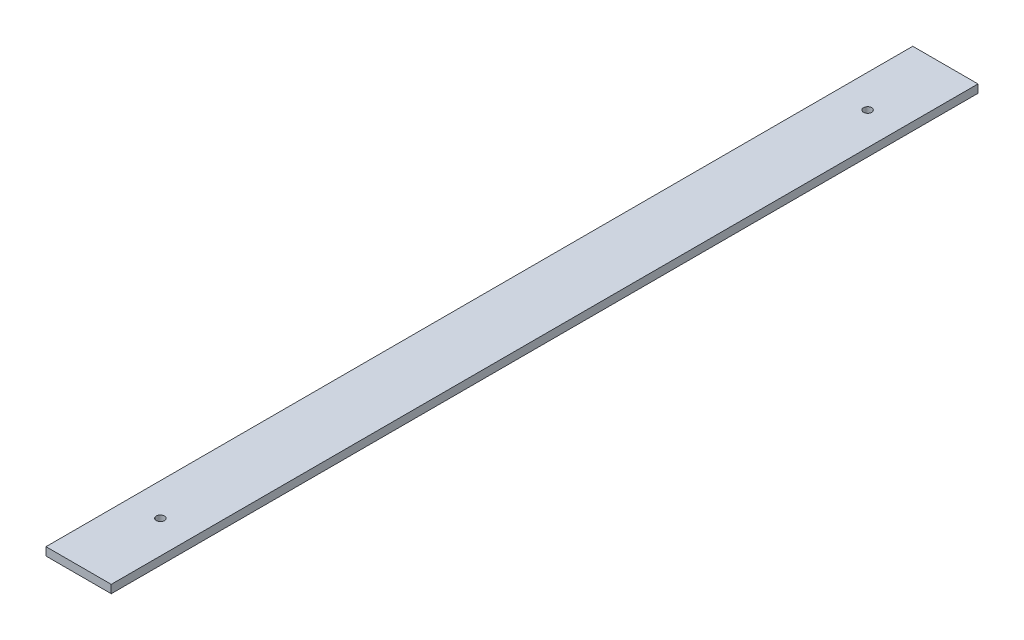
ISO-10303-21;
HEADER;
FILE_DESCRIPTION(('STEP AP214'),'2;1');
FILE_NAME('part.step','',(''),(''),'','','');
FILE_SCHEMA(('AUTOMOTIVE_DESIGN { 1 0 10303 214 1 1 1 1 }'));
ENDSEC;
DATA;
#1=APPLICATION_CONTEXT('core data for automotive mechanical design processes');
#2=APPLICATION_PROTOCOL_DEFINITION('international standard','automotive_design',2000,#1);
#3=PRODUCT_CONTEXT('',#1,'mechanical');
#4=PRODUCT('Part','Part','',(#3));
#5=PRODUCT_RELATED_PRODUCT_CATEGORY('part','',(#4));
#6=PRODUCT_DEFINITION_FORMATION('','',#4);
#7=PRODUCT_DEFINITION_CONTEXT('part definition',#1,'design');
#8=PRODUCT_DEFINITION('design','',#6,#7);
#9=PRODUCT_DEFINITION_SHAPE('','',#8);
#10=(LENGTH_UNIT() NAMED_UNIT(*) SI_UNIT(.MILLI.,.METRE.));
#11=(NAMED_UNIT(*) PLANE_ANGLE_UNIT() SI_UNIT($,.RADIAN.));
#12=(NAMED_UNIT(*) SI_UNIT($,.STERADIAN.) SOLID_ANGLE_UNIT());
#13=UNCERTAINTY_MEASURE_WITH_UNIT(LENGTH_MEASURE(1.E-05),#10,'distance_accuracy_value','');
#14=(GEOMETRIC_REPRESENTATION_CONTEXT(3) GLOBAL_UNCERTAINTY_ASSIGNED_CONTEXT((#13)) GLOBAL_UNIT_ASSIGNED_CONTEXT((#10,
#11,#12)) REPRESENTATION_CONTEXT('',''));
#15=CARTESIAN_POINT('',(0.,0.,0.));
#16=DIRECTION('',(0.,0.,1.));
#17=DIRECTION('',(1.,0.,0.));
#18=AXIS2_PLACEMENT_3D('',#15,#16,#17);
#19=CARTESIAN_POINT('',(0.,25.,0.));
#20=DIRECTION('',(0.,-1.,0.));
#21=DIRECTION('',(0.,0.,-1.));
#22=AXIS2_PLACEMENT_3D('',#19,#20,#21);
#23=PLANE('',#22);
#24=DIRECTION('',(0.,0.,-1.));
#25=VECTOR('',#24,1.);
#26=CARTESIAN_POINT('',(20932.9446458133,25.,9942.5828739722));
#27=LINE('',#26,#25);
#28=CARTESIAN_POINT('',(20932.9446458133,25.,12599.4325458721));
#29=VERTEX_POINT('',#28);
#30=CARTESIAN_POINT('',(20932.9446458133,25.,9942.5828739722));
#31=VERTEX_POINT('',#30);
#32=EDGE_CURVE('E102',#29,#31,#27,.T.);
#33=ORIENTED_EDGE('',*,*,#32,.T.);
#34=DIRECTION('',(-1.,0.,0.));
#35=VECTOR('',#34,1.);
#36=CARTESIAN_POINT('',(20932.9446458133,25.,9942.5828739722));
#37=LINE('',#36,#35);
#38=CARTESIAN_POINT('',(20732.9446458133,25.,9942.5828739722));
#39=VERTEX_POINT('',#38);
#40=EDGE_CURVE('E97',#31,#39,#37,.T.);
#41=ORIENTED_EDGE('',*,*,#40,.T.);
#42=DIRECTION('',(0.,0.,1.));
#43=VECTOR('',#42,1.);
#44=CARTESIAN_POINT('',(20732.9446458133,25.,9942.5828739722));
#45=LINE('',#44,#43);
#46=CARTESIAN_POINT('',(20732.9446458133,25.,12599.4325458721));
#47=VERTEX_POINT('',#46);
#48=EDGE_CURVE('E100',#39,#47,#45,.T.);
#49=ORIENTED_EDGE('',*,*,#48,.T.);
#50=DIRECTION('',(1.,0.,0.));
#51=VECTOR('',#50,1.);
#52=CARTESIAN_POINT('',(20932.9446458133,25.,12599.4325458721));
#53=LINE('',#52,#51);
#54=EDGE_CURVE('E67',#47,#29,#53,.T.);
#55=ORIENTED_EDGE('',*,*,#54,.T.);
#56=EDGE_LOOP('',(#33,#41,#49,#55));
#57=FACE_BOUND('',#56,.T.);
#58=CARTESIAN_POINT('',(20832.9446458133,25.,12348.754240871));
#59=DIRECTION('',(0.,1.,0.));
#60=DIRECTION('',(0.,0.,1.));
#61=AXIS2_PLACEMENT_3D('',#58,#59,#60);
#62=CIRCLE('',#61,12.4999999999988);
#63=CARTESIAN_POINT('',(20832.9446458133,25.,12361.254240871));
#64=VERTEX_POINT('',#63);
#65=EDGE_CURVE('E117',#64,#64,#62,.T.);
#66=ORIENTED_EDGE('',*,*,#65,.F.);
#67=EDGE_LOOP('',(#66));
#68=FACE_BOUND('',#67,.T.);
#69=CARTESIAN_POINT('',(20832.9446458133,25.,10181.0304593336));
#70=DIRECTION('',(0.,1.,0.));
#71=DIRECTION('',(0.,0.,1.));
#72=AXIS2_PLACEMENT_3D('',#69,#70,#71);
#73=CIRCLE('',#72,12.4999999999988);
#74=CARTESIAN_POINT('',(20832.9446458133,25.,10193.5304593336));
#75=VERTEX_POINT('',#74);
#76=EDGE_CURVE('E132',#75,#75,#73,.T.);
#77=ORIENTED_EDGE('',*,*,#76,.F.);
#78=EDGE_LOOP('',(#77));
#79=FACE_BOUND('',#78,.T.);
#80=ADVANCED_FACE('F50',(#57,#68,#79),#23,.F.);
#81=CARTESIAN_POINT('',(0.,0.,0.));
#82=DIRECTION('',(0.,-1.,0.));
#83=DIRECTION('',(0.,0.,-1.));
#84=AXIS2_PLACEMENT_3D('',#81,#82,#83);
#85=PLANE('',#84);
#86=CARTESIAN_POINT('',(20832.9446458133,0.,12348.754240871));
#87=DIRECTION('',(0.,1.,0.));
#88=DIRECTION('',(0.,0.,1.));
#89=AXIS2_PLACEMENT_3D('',#86,#87,#88);
#90=CIRCLE('',#89,12.4999999999988);
#91=CARTESIAN_POINT('',(20832.9446458133,0.,12361.254240871));
#92=VERTEX_POINT('',#91);
#93=EDGE_CURVE('E129',#92,#92,#90,.T.);
#94=ORIENTED_EDGE('',*,*,#93,.T.);
#95=EDGE_LOOP('',(#94));
#96=FACE_BOUND('',#95,.T.);
#97=DIRECTION('',(0.,0.,-1.));
#98=VECTOR('',#97,1.);
#99=CARTESIAN_POINT('',(20932.9446458133,0.,9942.5828739722));
#100=LINE('',#99,#98);
#101=CARTESIAN_POINT('',(20932.9446458133,0.,12599.4325458721));
#102=VERTEX_POINT('',#101);
#103=CARTESIAN_POINT('',(20932.9446458133,0.,9942.5828739722));
#104=VERTEX_POINT('',#103);
#105=EDGE_CURVE('E114',#102,#104,#100,.T.);
#106=ORIENTED_EDGE('',*,*,#105,.F.);
#107=DIRECTION('',(1.,0.,0.));
#108=VECTOR('',#107,1.);
#109=CARTESIAN_POINT('',(20932.9446458133,0.,12599.4325458721));
#110=LINE('',#109,#108);
#111=CARTESIAN_POINT('',(20732.9446458133,0.,12599.4325458721));
#112=VERTEX_POINT('',#111);
#113=EDGE_CURVE('E90',#112,#102,#110,.T.);
#114=ORIENTED_EDGE('',*,*,#113,.F.);
#115=DIRECTION('',(0.,0.,1.));
#116=VECTOR('',#115,1.);
#117=CARTESIAN_POINT('',(20732.9446458133,0.,9942.5828739722));
#118=LINE('',#117,#116);
#119=CARTESIAN_POINT('',(20732.9446458133,0.,9942.5828739722));
#120=VERTEX_POINT('',#119);
#121=EDGE_CURVE('E84',#120,#112,#118,.T.);
#122=ORIENTED_EDGE('',*,*,#121,.F.);
#123=DIRECTION('',(-1.,0.,0.));
#124=VECTOR('',#123,1.);
#125=CARTESIAN_POINT('',(20932.9446458133,0.,9942.5828739722));
#126=LINE('',#125,#124);
#127=EDGE_CURVE('E106',#104,#120,#126,.T.);
#128=ORIENTED_EDGE('',*,*,#127,.F.);
#129=EDGE_LOOP('',(#106,#114,#122,#128));
#130=FACE_BOUND('',#129,.T.);
#131=CARTESIAN_POINT('',(20832.9446458133,0.,10181.0304593336));
#132=DIRECTION('',(0.,1.,0.));
#133=DIRECTION('',(0.,0.,1.));
#134=AXIS2_PLACEMENT_3D('',#131,#132,#133);
#135=CIRCLE('',#134,12.4999999999988);
#136=CARTESIAN_POINT('',(20832.9446458133,0.,10193.5304593336));
#137=VERTEX_POINT('',#136);
#138=EDGE_CURVE('E135',#137,#137,#135,.T.);
#139=ORIENTED_EDGE('',*,*,#138,.T.);
#140=EDGE_LOOP('',(#139));
#141=FACE_BOUND('',#140,.T.);
#142=ADVANCED_FACE('F125',(#96,#130,#141),#85,.T.);
#143=CARTESIAN_POINT('',(20932.9446458133,25.,9942.5828739722));
#144=DIRECTION('',(-1.,0.,0.));
#145=DIRECTION('',(0.,0.,1.));
#146=AXIS2_PLACEMENT_3D('',#143,#144,#145);
#147=PLANE('',#146);
#148=ORIENTED_EDGE('',*,*,#105,.T.);
#149=DIRECTION('',(0.,-1.,0.));
#150=VECTOR('',#149,1.);
#151=CARTESIAN_POINT('',(20932.9446458133,25.,9942.5828739722));
#152=LINE('',#151,#150);
#153=EDGE_CURVE('E13',#31,#104,#152,.T.);
#154=ORIENTED_EDGE('',*,*,#153,.F.);
#155=ORIENTED_EDGE('',*,*,#32,.F.);
#156=DIRECTION('',(0.,-1.,0.));
#157=VECTOR('',#156,1.);
#158=CARTESIAN_POINT('',(20932.9446458133,25.,12599.4325458721));
#159=LINE('',#158,#157);
#160=EDGE_CURVE('E110',#29,#102,#159,.T.);
#161=ORIENTED_EDGE('',*,*,#160,.T.);
#162=EDGE_LOOP('',(#148,#154,#155,#161));
#163=FACE_BOUND('',#162,.T.);
#164=ADVANCED_FACE('F52',(#163),#147,.F.);
#165=CARTESIAN_POINT('',(20932.9446458133,25.,9942.5828739722));
#166=DIRECTION('',(0.,0.,1.));
#167=DIRECTION('',(1.,0.,0.));
#168=AXIS2_PLACEMENT_3D('',#165,#166,#167);
#169=PLANE('',#168);
#170=ORIENTED_EDGE('',*,*,#127,.T.);
#171=DIRECTION('',(0.,-1.,0.));
#172=VECTOR('',#171,1.);
#173=CARTESIAN_POINT('',(20732.9446458133,25.,9942.5828739722));
#174=LINE('',#173,#172);
#175=EDGE_CURVE('E59',#39,#120,#174,.T.);
#176=ORIENTED_EDGE('',*,*,#175,.F.);
#177=ORIENTED_EDGE('',*,*,#40,.F.);
#178=ORIENTED_EDGE('',*,*,#153,.T.);
#179=EDGE_LOOP('',(#170,#176,#177,#178));
#180=FACE_BOUND('',#179,.T.);
#181=ADVANCED_FACE('F105',(#180),#169,.F.);
#182=CARTESIAN_POINT('',(20732.9446458133,25.,9942.5828739722));
#183=DIRECTION('',(1.,0.,0.));
#184=DIRECTION('',(0.,0.,-1.));
#185=AXIS2_PLACEMENT_3D('',#182,#183,#184);
#186=PLANE('',#185);
#187=ORIENTED_EDGE('',*,*,#121,.T.);
#188=DIRECTION('',(0.,-1.,0.));
#189=VECTOR('',#188,1.);
#190=CARTESIAN_POINT('',(20732.9446458133,25.,12599.4325458721));
#191=LINE('',#190,#189);
#192=EDGE_CURVE('E107',#47,#112,#191,.T.);
#193=ORIENTED_EDGE('',*,*,#192,.F.);
#194=ORIENTED_EDGE('',*,*,#48,.F.);
#195=ORIENTED_EDGE('',*,*,#175,.T.);
#196=EDGE_LOOP('',(#187,#193,#194,#195));
#197=FACE_BOUND('',#196,.T.);
#198=ADVANCED_FACE('F108',(#197),#186,.F.);
#199=CARTESIAN_POINT('',(20932.9446458133,25.,12599.4325458721));
#200=DIRECTION('',(0.,0.,-1.));
#201=DIRECTION('',(-1.,0.,0.));
#202=AXIS2_PLACEMENT_3D('',#199,#200,#201);
#203=PLANE('',#202);
#204=ORIENTED_EDGE('',*,*,#113,.T.);
#205=ORIENTED_EDGE('',*,*,#160,.F.);
#206=ORIENTED_EDGE('',*,*,#54,.F.);
#207=ORIENTED_EDGE('',*,*,#192,.T.);
#208=EDGE_LOOP('',(#204,#205,#206,#207));
#209=FACE_BOUND('',#208,.T.);
#210=ADVANCED_FACE('F122',(#209),#203,.F.);
#211=CARTESIAN_POINT('',(20832.9446458133,25.,12348.754240871));
#212=DIRECTION('',(0.,-1.,0.));
#213=DIRECTION('',(0.,0.,-1.));
#214=AXIS2_PLACEMENT_3D('',#211,#212,#213);
#215=CYLINDRICAL_SURFACE('',#214,12.4999999999988);
#216=ORIENTED_EDGE('',*,*,#65,.T.);
#217=EDGE_LOOP('',(#216));
#218=FACE_BOUND('',#217,.T.);
#219=ORIENTED_EDGE('',*,*,#93,.F.);
#220=EDGE_LOOP('',(#219));
#221=FACE_BOUND('',#220,.T.);
#222=ADVANCED_FACE('F152',(#218,#221),#215,.F.);
#223=CARTESIAN_POINT('',(20832.9446458133,25.,10181.0304593336));
#224=DIRECTION('',(0.,-1.,0.));
#225=DIRECTION('',(0.,0.,-1.));
#226=AXIS2_PLACEMENT_3D('',#223,#224,#225);
#227=CYLINDRICAL_SURFACE('',#226,12.4999999999988);
#228=ORIENTED_EDGE('',*,*,#76,.T.);
#229=EDGE_LOOP('',(#228));
#230=FACE_BOUND('',#229,.T.);
#231=ORIENTED_EDGE('',*,*,#138,.F.);
#232=EDGE_LOOP('',(#231));
#233=FACE_BOUND('',#232,.T.);
#234=ADVANCED_FACE('F141',(#230,#233),#227,.F.);
#235=CLOSED_SHELL('',(#80,#142,#164,#181,#198,#210,#222,#234));
#236=MANIFOLD_SOLID_BREP('B2',#235);
#237=ADVANCED_BREP_SHAPE_REPRESENTATION('',(#18,#236),#14);
#238=SHAPE_DEFINITION_REPRESENTATION(#9,#237);
ENDSEC;
END-ISO-10303-21;
